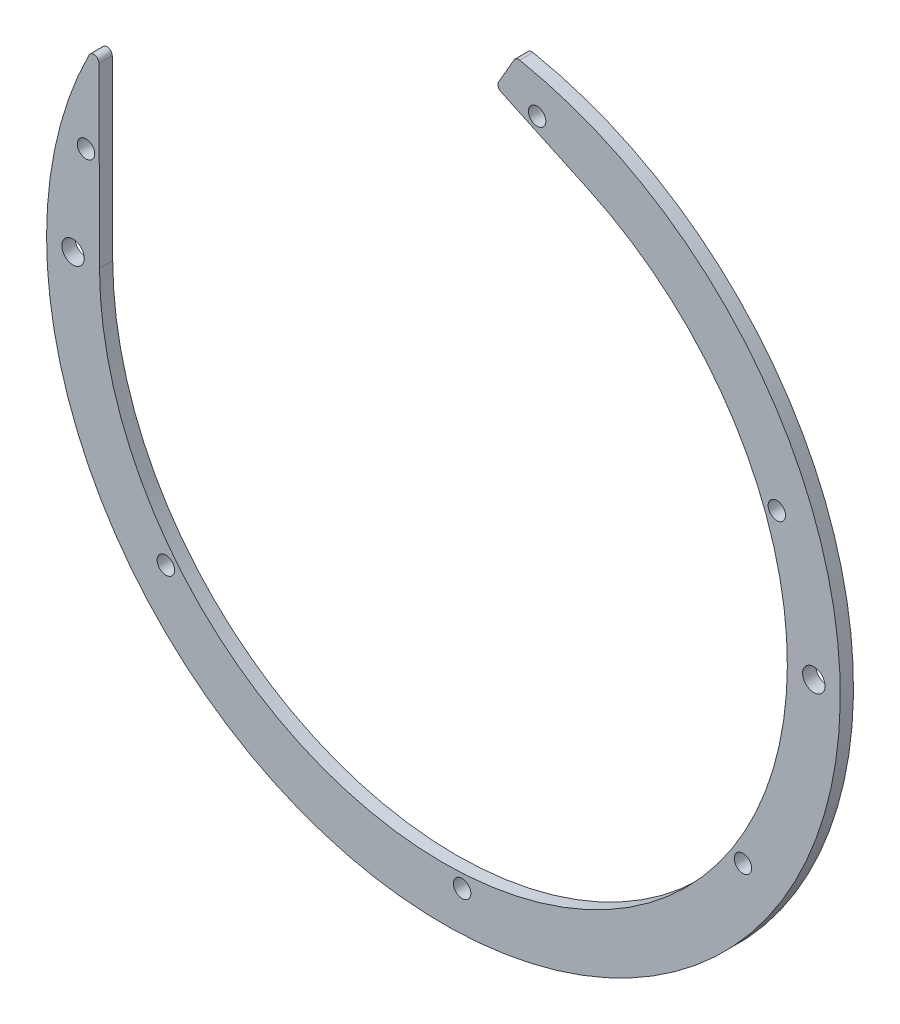
ISO-10303-21;
HEADER;
FILE_DESCRIPTION(('STEP AP214'),'2;1');
FILE_NAME('part.step','',(''),(''),'','','');
FILE_SCHEMA(('AUTOMOTIVE_DESIGN { 1 0 10303 214 1 1 1 1 }'));
ENDSEC;
DATA;
#1=APPLICATION_CONTEXT('core data for automotive mechanical design processes');
#2=APPLICATION_PROTOCOL_DEFINITION('international standard','automotive_design',2000,#1);
#3=PRODUCT_CONTEXT('',#1,'mechanical');
#4=PRODUCT('Part','Part','',(#3));
#5=PRODUCT_RELATED_PRODUCT_CATEGORY('part','',(#4));
#6=PRODUCT_DEFINITION_FORMATION('','',#4);
#7=PRODUCT_DEFINITION_CONTEXT('part definition',#1,'design');
#8=PRODUCT_DEFINITION('design','',#6,#7);
#9=PRODUCT_DEFINITION_SHAPE('','',#8);
#10=(LENGTH_UNIT() NAMED_UNIT(*) SI_UNIT(.MILLI.,.METRE.));
#11=(NAMED_UNIT(*) PLANE_ANGLE_UNIT() SI_UNIT($,.RADIAN.));
#12=(NAMED_UNIT(*) SI_UNIT($,.STERADIAN.) SOLID_ANGLE_UNIT());
#13=UNCERTAINTY_MEASURE_WITH_UNIT(LENGTH_MEASURE(1.E-05),#10,'distance_accuracy_value','');
#14=(GEOMETRIC_REPRESENTATION_CONTEXT(3) GLOBAL_UNCERTAINTY_ASSIGNED_CONTEXT((#13)) GLOBAL_UNIT_ASSIGNED_CONTEXT((#10,
#11,#12)) REPRESENTATION_CONTEXT('',''));
#15=CARTESIAN_POINT('',(0.,0.,0.));
#16=DIRECTION('',(0.,0.,1.));
#17=DIRECTION('',(1.,0.,0.));
#18=AXIS2_PLACEMENT_3D('',#15,#16,#17);
#19=CARTESIAN_POINT('',(0.,0.,-5.));
#20=DIRECTION('',(0.,0.,1.));
#21=DIRECTION('',(-1.,0.,0.));
#22=AXIS2_PLACEMENT_3D('',#19,#20,#21);
#23=CYLINDRICAL_SURFACE('',#22,150.);
#24=CARTESIAN_POINT('',(0.,0.,0.));
#25=DIRECTION('',(0.,0.,1.));
#26=DIRECTION('',(-1.,0.,0.));
#27=AXIS2_PLACEMENT_3D('',#24,#25,#26);
#28=CIRCLE('',#27,150.);
#29=CARTESIAN_POINT('',(-133.953391528007,67.5017695926886,0.));
#30=VERTEX_POINT('',#29);
#31=CARTESIAN_POINT('',(28.8334780285495,147.202685249887,0.));
#32=VERTEX_POINT('',#31);
#33=EDGE_CURVE('E135',#30,#32,#28,.T.);
#34=ORIENTED_EDGE('',*,*,#33,.F.);
#35=DIRECTION('',(0.,0.,1.));
#36=VECTOR('',#35,1.);
#37=CARTESIAN_POINT('',(-133.953391528007,67.5017695926886,-5.));
#38=LINE('',#37,#36);
#39=CARTESIAN_POINT('',(-133.953391528007,67.5017695926886,-5.));
#40=VERTEX_POINT('',#39);
#41=EDGE_CURVE('E190',#40,#30,#38,.T.);
#42=ORIENTED_EDGE('',*,*,#41,.F.);
#43=CARTESIAN_POINT('',(0.,0.,-5.));
#44=DIRECTION('',(0.,0.,1.));
#45=DIRECTION('',(-1.,0.,0.));
#46=AXIS2_PLACEMENT_3D('',#43,#44,#45);
#47=CIRCLE('',#46,150.);
#48=CARTESIAN_POINT('',(28.8334780285495,147.202685249887,-5.));
#49=VERTEX_POINT('',#48);
#50=EDGE_CURVE('E130',#40,#49,#47,.T.);
#51=ORIENTED_EDGE('',*,*,#50,.T.);
#52=DIRECTION('',(0.,0.,1.));
#53=VECTOR('',#52,1.);
#54=CARTESIAN_POINT('',(28.8334780285495,147.202685249887,-5.));
#55=LINE('',#54,#53);
#56=EDGE_CURVE('E47',#32,#49,#55,.F.);
#57=ORIENTED_EDGE('',*,*,#56,.F.);
#58=EDGE_LOOP('',(#34,#42,#51,#57));
#59=FACE_BOUND('',#58,.T.);
#60=ADVANCED_FACE('F38',(#59),#23,.T.);
#61=CARTESIAN_POINT('',(27.4277530561865,147.471076358345,-5.));
#62=DIRECTION('',(0.866025403784439,-0.5,0.));
#63=DIRECTION('',(0.5,0.866025403784439,0.));
#64=AXIS2_PLACEMENT_3D('',#61,#62,#63);
#65=PLANE('',#64);
#66=DIRECTION('',(-0.5,-0.866025403784439,0.));
#67=VECTOR('',#66,1.);
#68=CARTESIAN_POINT('',(27.4277530561865,147.471076358345,0.));
#69=LINE('',#68,#67);
#70=CARTESIAN_POINT('',(26.7169808472666,146.239982779888,0.));
#71=VERTEX_POINT('',#70);
#72=CARTESIAN_POINT('',(20.8671165029872,136.107720518211,0.));
#73=VERTEX_POINT('',#72);
#74=EDGE_CURVE('E138',#71,#73,#69,.T.);
#75=ORIENTED_EDGE('',*,*,#74,.F.);
#76=DIRECTION('',(0.,0.,1.));
#77=VECTOR('',#76,1.);
#78=CARTESIAN_POINT('',(26.7169808472666,146.239982779888,-5.));
#79=LINE('',#78,#77);
#80=CARTESIAN_POINT('',(26.7169808472666,146.239982779888,-5.));
#81=VERTEX_POINT('',#80);
#82=EDGE_CURVE('E180',#81,#71,#79,.T.);
#83=ORIENTED_EDGE('',*,*,#82,.F.);
#84=DIRECTION('',(-0.5,-0.866025403784439,0.));
#85=VECTOR('',#84,1.);
#86=CARTESIAN_POINT('',(27.4277530561865,147.471076358345,-5.));
#87=LINE('',#86,#85);
#88=CARTESIAN_POINT('',(20.8671165029872,136.107720518211,-5.));
#89=VERTEX_POINT('',#88);
#90=EDGE_CURVE('E127',#81,#89,#87,.T.);
#91=ORIENTED_EDGE('',*,*,#90,.T.);
#92=DIRECTION('',(0.,0.,1.));
#93=VECTOR('',#92,1.);
#94=CARTESIAN_POINT('',(20.8671165029872,136.107720518211,-5.));
#95=LINE('',#94,#93);
#96=EDGE_CURVE('E183',#73,#89,#95,.F.);
#97=ORIENTED_EDGE('',*,*,#96,.F.);
#98=EDGE_LOOP('',(#75,#83,#91,#97));
#99=FACE_BOUND('',#98,.T.);
#100=ADVANCED_FACE('F234',(#99),#65,.F.);
#101=CARTESIAN_POINT('',(54.940374026291,117.820012314764,-5.));
#102=DIRECTION('',(0.4226182617407,0.90630778703665,0.));
#103=DIRECTION('',(-0.90630778703665,0.4226182617407,0.));
#104=AXIS2_PLACEMENT_3D('',#101,#102,#103);
#105=PLANE('',#104);
#106=DIRECTION('',(0.90630778703665,-0.4226182617407,0.));
#107=VECTOR('',#106,1.);
#108=CARTESIAN_POINT('',(54.940374026291,117.820012314764,-5.));
#109=LINE('',#108,#107);
#110=CARTESIAN_POINT('',(21.7539307870747,133.295104944137,-5.));
#111=VERTEX_POINT('',#110);
#112=CARTESIAN_POINT('',(54.940374026291,117.820012314764,-5.));
#113=VERTEX_POINT('',#112);
#114=EDGE_CURVE('E106',#111,#113,#109,.T.);
#115=ORIENTED_EDGE('',*,*,#114,.T.);
#116=DIRECTION('',(0.,0.,1.));
#117=VECTOR('',#116,1.);
#118=CARTESIAN_POINT('',(54.940374026291,117.820012314764,-5.));
#119=LINE('',#118,#117);
#120=CARTESIAN_POINT('',(54.940374026291,117.820012314764,0.));
#121=VERTEX_POINT('',#120);
#122=EDGE_CURVE('E114',#113,#121,#119,.T.);
#123=ORIENTED_EDGE('',*,*,#122,.T.);
#124=DIRECTION('',(0.90630778703665,-0.4226182617407,0.));
#125=VECTOR('',#124,1.);
#126=CARTESIAN_POINT('',(54.940374026291,117.820012314764,0.));
#127=LINE('',#126,#125);
#128=CARTESIAN_POINT('',(21.7539307870747,133.295104944137,0.));
#129=VERTEX_POINT('',#128);
#130=EDGE_CURVE('E142',#129,#121,#127,.T.);
#131=ORIENTED_EDGE('',*,*,#130,.F.);
#132=DIRECTION('',(0.,0.,1.));
#133=VECTOR('',#132,1.);
#134=CARTESIAN_POINT('',(21.7539307870747,133.295104944137,-5.));
#135=LINE('',#134,#133);
#136=EDGE_CURVE('E121',#111,#129,#135,.T.);
#137=ORIENTED_EDGE('',*,*,#136,.F.);
#138=EDGE_LOOP('',(#115,#123,#131,#137));
#139=FACE_BOUND('',#138,.T.);
#140=ADVANCED_FACE('F125',(#139),#105,.F.);
#141=CARTESIAN_POINT('',(0.,0.,-5.));
#142=DIRECTION('',(0.,0.,1.));
#143=DIRECTION('',(-1.,0.,0.));
#144=AXIS2_PLACEMENT_3D('',#141,#142,#143);
#145=CYLINDRICAL_SURFACE('',#144,130.);
#146=CARTESIAN_POINT('',(0.,0.,0.));
#147=DIRECTION('',(0.,0.,-1.));
#148=DIRECTION('',(-1.,0.,0.));
#149=AXIS2_PLACEMENT_3D('',#146,#147,#148);
#150=CIRCLE('',#149,130.);
#151=CARTESIAN_POINT('',(-129.999591664017,-0.325833069146089,0.));
#152=VERTEX_POINT('',#151);
#153=EDGE_CURVE('E117',#121,#152,#150,.T.);
#154=ORIENTED_EDGE('',*,*,#153,.F.);
#155=ORIENTED_EDGE('',*,*,#122,.F.);
#156=CARTESIAN_POINT('',(0.,0.,-5.));
#157=DIRECTION('',(0.,0.,-1.));
#158=DIRECTION('',(-1.,0.,0.));
#159=AXIS2_PLACEMENT_3D('',#156,#157,#158);
#160=CIRCLE('',#159,130.);
#161=CARTESIAN_POINT('',(-129.999591664017,-0.325833069146089,-5.));
#162=VERTEX_POINT('',#161);
#163=EDGE_CURVE('E102',#113,#162,#160,.T.);
#164=ORIENTED_EDGE('',*,*,#163,.T.);
#165=DIRECTION('',(0.,0.,1.));
#166=VECTOR('',#165,1.);
#167=CARTESIAN_POINT('',(-129.999591664017,-0.325833069146089,-5.));
#168=LINE('',#167,#166);
#169=EDGE_CURVE('E122',#162,#152,#168,.T.);
#170=ORIENTED_EDGE('',*,*,#169,.T.);
#171=EDGE_LOOP('',(#154,#155,#164,#170));
#172=FACE_BOUND('',#171,.T.);
#173=ADVANCED_FACE('F115',(#172),#145,.F.);
#174=CARTESIAN_POINT('',(-130.187154080944,74.5070796119715,-5.));
#175=DIRECTION('',(-0.999996858953974,-0.0025064082242006,0.));
#176=DIRECTION('',(0.0025064082242006,-0.999996858953974,0.));
#177=AXIS2_PLACEMENT_3D('',#174,#175,#176);
#178=PLANE('',#177);
#179=DIRECTION('',(-0.0025064082242006,0.999996858953974,0.));
#180=VECTOR('',#179,1.);
#181=CARTESIAN_POINT('',(-130.187154080944,74.5070796119715,0.));
#182=LINE('',#181,#180);
#183=CARTESIAN_POINT('',(-130.167352589726,66.6067588145679,0.));
#184=VERTEX_POINT('',#183);
#185=EDGE_CURVE('E145',#152,#184,#182,.T.);
#186=ORIENTED_EDGE('',*,*,#185,.F.);
#187=ORIENTED_EDGE('',*,*,#169,.F.);
#188=DIRECTION('',(-0.0025064082242006,0.999996858953974,0.));
#189=VECTOR('',#188,1.);
#190=CARTESIAN_POINT('',(-130.187154080944,74.5070796119715,-5.));
#191=LINE('',#190,#189);
#192=CARTESIAN_POINT('',(-130.167352589726,66.6067588145679,-5.));
#193=VERTEX_POINT('',#192);
#194=EDGE_CURVE('E108',#162,#193,#191,.T.);
#195=ORIENTED_EDGE('',*,*,#194,.T.);
#196=DIRECTION('',(0.,0.,1.));
#197=VECTOR('',#196,1.);
#198=CARTESIAN_POINT('',(-130.167352589726,66.6067588145679,-5.));
#199=LINE('',#198,#197);
#200=EDGE_CURVE('E11',#184,#193,#199,.F.);
#201=ORIENTED_EDGE('',*,*,#200,.F.);
#202=EDGE_LOOP('',(#186,#187,#195,#201));
#203=FACE_BOUND('',#202,.T.);
#204=ADVANCED_FACE('F225',(#203),#178,.F.);
#205=CARTESIAN_POINT('',(0.,0.,-5.));
#206=DIRECTION('',(0.,0.,1.));
#207=DIRECTION('',(-1.,0.,0.));
#208=AXIS2_PLACEMENT_3D('',#205,#206,#207);
#209=PLANE('',#208);
#210=CARTESIAN_POINT('',(-140.,0.,-5.));
#211=DIRECTION('',(0.,0.,1.));
#212=DIRECTION('',(1.,0.,0.));
#213=AXIS2_PLACEMENT_3D('',#210,#211,#212);
#214=CIRCLE('',#213,4.25);
#215=CARTESIAN_POINT('',(-135.75,0.,-5.));
#216=VERTEX_POINT('',#215);
#217=EDGE_CURVE('E195',#216,#216,#214,.T.);
#218=ORIENTED_EDGE('',*,*,#217,.T.);
#219=EDGE_LOOP('',(#218));
#220=FACE_BOUND('',#219,.T.);
#221=CARTESIAN_POINT('',(140.,-9.6038628438766E-13,-5.));
#222=DIRECTION('',(0.,0.,1.));
#223=DIRECTION('',(1.,0.,0.));
#224=AXIS2_PLACEMENT_3D('',#221,#222,#223);
#225=CIRCLE('',#224,4.25);
#226=CARTESIAN_POINT('',(144.25,-9.6038628438766E-13,-5.));
#227=VERTEX_POINT('',#226);
#228=EDGE_CURVE('E172',#227,#227,#225,.T.);
#229=ORIENTED_EDGE('',*,*,#228,.T.);
#230=EDGE_LOOP('',(#229));
#231=FACE_BOUND('',#230,.T.);
#232=CARTESIAN_POINT('',(126.033357577122,48.3796731886171,-5.));
#233=DIRECTION('',(0.,0.,-1.));
#234=DIRECTION('',(-1.,0.,0.));
#235=AXIS2_PLACEMENT_3D('',#232,#233,#234);
#236=CIRCLE('',#235,3.3);
#237=CARTESIAN_POINT('',(122.733357577122,48.3796731886171,-5.));
#238=VERTEX_POINT('',#237);
#239=EDGE_CURVE('E168',#238,#238,#236,.T.);
#240=ORIENTED_EDGE('',*,*,#239,.F.);
#241=EDGE_LOOP('',(#240));
#242=FACE_BOUND('',#241,.T.);
#243=CARTESIAN_POINT('',(35.411080451429,132.155951395642,-5.));
#244=DIRECTION('',(0.,0.,-1.));
#245=DIRECTION('',(-1.,0.,0.));
#246=AXIS2_PLACEMENT_3D('',#243,#244,#245);
#247=CIRCLE('',#246,3.3);
#248=CARTESIAN_POINT('',(32.111080451429,132.155951395642,-5.));
#249=VERTEX_POINT('',#248);
#250=EDGE_CURVE('E164',#249,#249,#247,.T.);
#251=ORIENTED_EDGE('',*,*,#250,.F.);
#252=EDGE_LOOP('',(#251));
#253=FACE_BOUND('',#252,.T.);
#254=CARTESIAN_POINT('',(113.220526672633,-73.5262697270275,-5.));
#255=DIRECTION('',(0.,0.,-1.));
#256=DIRECTION('',(-1.,0.,0.));
#257=AXIS2_PLACEMENT_3D('',#254,#255,#256);
#258=CIRCLE('',#257,3.3);
#259=CARTESIAN_POINT('',(109.920526672633,-73.5262697270275,-5.));
#260=VERTEX_POINT('',#259);
#261=EDGE_CURVE('E160',#260,#260,#258,.T.);
#262=ORIENTED_EDGE('',*,*,#261,.F.);
#263=EDGE_LOOP('',(#262));
#264=FACE_BOUND('',#263,.T.);
#265=CARTESIAN_POINT('',(7.06535409279951,-134.814987191867,-5.));
#266=DIRECTION('',(0.,0.,-1.));
#267=DIRECTION('',(-1.,0.,0.));
#268=AXIS2_PLACEMENT_3D('',#265,#266,#267);
#269=CIRCLE('',#268,3.3);
#270=CARTESIAN_POINT('',(3.76535409279952,-134.814987191867,-5.));
#271=VERTEX_POINT('',#270);
#272=EDGE_CURVE('E156',#271,#271,#269,.T.);
#273=ORIENTED_EDGE('',*,*,#272,.F.);
#274=EDGE_LOOP('',(#273));
#275=FACE_BOUND('',#274,.T.);
#276=CARTESIAN_POINT('',(-104.914704796689,-84.9582527917303,-5.));
#277=DIRECTION('',(0.,0.,-1.));
#278=DIRECTION('',(-1.,0.,0.));
#279=AXIS2_PLACEMENT_3D('',#276,#277,#278);
#280=CIRCLE('',#279,3.3);
#281=CARTESIAN_POINT('',(-108.214704796689,-84.9582527917303,-5.));
#282=VERTEX_POINT('',#281);
#283=EDGE_CURVE('E152',#282,#282,#280,.T.);
#284=ORIENTED_EDGE('',*,*,#283,.F.);
#285=EDGE_LOOP('',(#284));
#286=FACE_BOUND('',#285,.T.);
#287=CARTESIAN_POINT('',(-135.091150201132,36.1975646009845,-5.));
#288=DIRECTION('',(0.,0.,-1.));
#289=DIRECTION('',(-1.,0.,0.));
#290=AXIS2_PLACEMENT_3D('',#287,#288,#289);
#291=CIRCLE('',#290,3.3);
#292=CARTESIAN_POINT('',(-138.391150201132,36.1975646009845,-5.));
#293=VERTEX_POINT('',#292);
#294=EDGE_CURVE('E139',#293,#293,#291,.T.);
#295=ORIENTED_EDGE('',*,*,#294,.F.);
#296=EDGE_LOOP('',(#295));
#297=FACE_BOUND('',#296,.T.);
#298=ORIENTED_EDGE('',*,*,#90,.F.);
#299=CARTESIAN_POINT('',(28.4490316548355,145.239982779888,-5.));
#300=DIRECTION('',(0.,0.,-1.));
#301=DIRECTION('',(-1.,0.,0.));
#302=AXIS2_PLACEMENT_3D('',#299,#300,#301);
#303=CIRCLE('',#302,2.);
#304=EDGE_CURVE('E60',#49,#81,#303,.F.);
#305=ORIENTED_EDGE('',*,*,#304,.F.);
#306=ORIENTED_EDGE('',*,*,#50,.F.);
#307=CARTESIAN_POINT('',(-132.167346307634,66.6017459981195,-5.));
#308=DIRECTION('',(0.,0.,-1.));
#309=DIRECTION('',(-1.,0.,0.));
#310=AXIS2_PLACEMENT_3D('',#307,#308,#309);
#311=CIRCLE('',#310,2.);
#312=EDGE_CURVE('E55',#193,#40,#311,.F.);
#313=ORIENTED_EDGE('',*,*,#312,.F.);
#314=ORIENTED_EDGE('',*,*,#194,.F.);
#315=ORIENTED_EDGE('',*,*,#163,.F.);
#316=ORIENTED_EDGE('',*,*,#114,.F.);
#317=CARTESIAN_POINT('',(22.5991673105561,135.107720518211,-5.));
#318=DIRECTION('',(0.,0.,-1.));
#319=DIRECTION('',(-1.,0.,0.));
#320=AXIS2_PLACEMENT_3D('',#317,#318,#319);
#321=CIRCLE('',#320,2.);
#322=EDGE_CURVE('E188',#89,#111,#321,.F.);
#323=ORIENTED_EDGE('',*,*,#322,.F.);
#324=EDGE_LOOP('',(#298,#305,#306,#313,#314,#315,#316,#323));
#325=FACE_BOUND('',#324,.T.);
#326=ADVANCED_FACE('F104',(#220,#231,#242,#253,#264,#275,#286,#297,#325),#209,.F.);
#327=CARTESIAN_POINT('',(0.,0.,0.));
#328=DIRECTION('',(0.,0.,1.));
#329=DIRECTION('',(-1.,0.,0.));
#330=AXIS2_PLACEMENT_3D('',#327,#328,#329);
#331=PLANE('',#330);
#332=CARTESIAN_POINT('',(-140.,0.,0.));
#333=DIRECTION('',(0.,0.,1.));
#334=DIRECTION('',(1.,0.,0.));
#335=AXIS2_PLACEMENT_3D('',#332,#333,#334);
#336=CIRCLE('',#335,4.25);
#337=CARTESIAN_POINT('',(-135.75,0.,0.));
#338=VERTEX_POINT('',#337);
#339=EDGE_CURVE('E42',#338,#338,#336,.T.);
#340=ORIENTED_EDGE('',*,*,#339,.F.);
#341=EDGE_LOOP('',(#340));
#342=FACE_BOUND('',#341,.T.);
#343=CARTESIAN_POINT('',(140.,-9.6038628438766E-13,0.));
#344=DIRECTION('',(0.,0.,1.));
#345=DIRECTION('',(1.,0.,0.));
#346=AXIS2_PLACEMENT_3D('',#343,#344,#345);
#347=CIRCLE('',#346,4.25);
#348=CARTESIAN_POINT('',(144.25,-9.6038628438766E-13,0.));
#349=VERTEX_POINT('',#348);
#350=EDGE_CURVE('E193',#349,#349,#347,.T.);
#351=ORIENTED_EDGE('',*,*,#350,.F.);
#352=EDGE_LOOP('',(#351));
#353=FACE_BOUND('',#352,.T.);
#354=CARTESIAN_POINT('',(126.033357577122,48.3796731886171,0.));
#355=DIRECTION('',(0.,0.,-1.));
#356=DIRECTION('',(-1.,0.,0.));
#357=AXIS2_PLACEMENT_3D('',#354,#355,#356);
#358=CIRCLE('',#357,3.3);
#359=CARTESIAN_POINT('',(122.733357577122,48.3796731886171,0.));
#360=VERTEX_POINT('',#359);
#361=EDGE_CURVE('E169',#360,#360,#358,.T.);
#362=ORIENTED_EDGE('',*,*,#361,.T.);
#363=EDGE_LOOP('',(#362));
#364=FACE_BOUND('',#363,.T.);
#365=CARTESIAN_POINT('',(35.411080451429,132.155951395642,0.));
#366=DIRECTION('',(0.,0.,-1.));
#367=DIRECTION('',(-1.,0.,0.));
#368=AXIS2_PLACEMENT_3D('',#365,#366,#367);
#369=CIRCLE('',#368,3.3);
#370=CARTESIAN_POINT('',(32.111080451429,132.155951395642,0.));
#371=VERTEX_POINT('',#370);
#372=EDGE_CURVE('E165',#371,#371,#369,.T.);
#373=ORIENTED_EDGE('',*,*,#372,.T.);
#374=EDGE_LOOP('',(#373));
#375=FACE_BOUND('',#374,.T.);
#376=CARTESIAN_POINT('',(113.220526672633,-73.5262697270275,0.));
#377=DIRECTION('',(0.,0.,-1.));
#378=DIRECTION('',(-1.,0.,0.));
#379=AXIS2_PLACEMENT_3D('',#376,#377,#378);
#380=CIRCLE('',#379,3.3);
#381=CARTESIAN_POINT('',(109.920526672633,-73.5262697270275,0.));
#382=VERTEX_POINT('',#381);
#383=EDGE_CURVE('E161',#382,#382,#380,.T.);
#384=ORIENTED_EDGE('',*,*,#383,.T.);
#385=EDGE_LOOP('',(#384));
#386=FACE_BOUND('',#385,.T.);
#387=CARTESIAN_POINT('',(7.06535409279951,-134.814987191867,0.));
#388=DIRECTION('',(0.,0.,-1.));
#389=DIRECTION('',(-1.,0.,0.));
#390=AXIS2_PLACEMENT_3D('',#387,#388,#389);
#391=CIRCLE('',#390,3.3);
#392=CARTESIAN_POINT('',(3.76535409279952,-134.814987191867,0.));
#393=VERTEX_POINT('',#392);
#394=EDGE_CURVE('E157',#393,#393,#391,.T.);
#395=ORIENTED_EDGE('',*,*,#394,.T.);
#396=EDGE_LOOP('',(#395));
#397=FACE_BOUND('',#396,.T.);
#398=CARTESIAN_POINT('',(-104.914704796689,-84.9582527917303,0.));
#399=DIRECTION('',(0.,0.,-1.));
#400=DIRECTION('',(-1.,0.,0.));
#401=AXIS2_PLACEMENT_3D('',#398,#399,#400);
#402=CIRCLE('',#401,3.3);
#403=CARTESIAN_POINT('',(-108.214704796689,-84.9582527917303,0.));
#404=VERTEX_POINT('',#403);
#405=EDGE_CURVE('E153',#404,#404,#402,.T.);
#406=ORIENTED_EDGE('',*,*,#405,.T.);
#407=EDGE_LOOP('',(#406));
#408=FACE_BOUND('',#407,.T.);
#409=CARTESIAN_POINT('',(-135.091150201132,36.1975646009845,0.));
#410=DIRECTION('',(0.,0.,-1.));
#411=DIRECTION('',(-1.,0.,0.));
#412=AXIS2_PLACEMENT_3D('',#409,#410,#411);
#413=CIRCLE('',#412,3.3);
#414=CARTESIAN_POINT('',(-138.391150201132,36.1975646009845,0.));
#415=VERTEX_POINT('',#414);
#416=EDGE_CURVE('E149',#415,#415,#413,.T.);
#417=ORIENTED_EDGE('',*,*,#416,.T.);
#418=EDGE_LOOP('',(#417));
#419=FACE_BOUND('',#418,.T.);
#420=ORIENTED_EDGE('',*,*,#130,.T.);
#421=ORIENTED_EDGE('',*,*,#153,.T.);
#422=ORIENTED_EDGE('',*,*,#185,.T.);
#423=CARTESIAN_POINT('',(-132.167346307634,66.6017459981195,0.));
#424=DIRECTION('',(0.,0.,-1.));
#425=DIRECTION('',(-1.,0.,0.));
#426=AXIS2_PLACEMENT_3D('',#423,#424,#425);
#427=CIRCLE('',#426,2.);
#428=EDGE_CURVE('E174',#30,#184,#427,.T.);
#429=ORIENTED_EDGE('',*,*,#428,.F.);
#430=ORIENTED_EDGE('',*,*,#33,.T.);
#431=CARTESIAN_POINT('',(28.4490316548355,145.239982779888,0.));
#432=DIRECTION('',(0.,0.,-1.));
#433=DIRECTION('',(-1.,0.,0.));
#434=AXIS2_PLACEMENT_3D('',#431,#432,#433);
#435=CIRCLE('',#434,2.);
#436=EDGE_CURVE('E176',#71,#32,#435,.T.);
#437=ORIENTED_EDGE('',*,*,#436,.F.);
#438=ORIENTED_EDGE('',*,*,#74,.T.);
#439=CARTESIAN_POINT('',(22.5991673105561,135.107720518211,0.));
#440=DIRECTION('',(0.,0.,-1.));
#441=DIRECTION('',(-1.,0.,0.));
#442=AXIS2_PLACEMENT_3D('',#439,#440,#441);
#443=CIRCLE('',#442,2.);
#444=EDGE_CURVE('E178',#129,#73,#443,.T.);
#445=ORIENTED_EDGE('',*,*,#444,.F.);
#446=EDGE_LOOP('',(#420,#421,#422,#429,#430,#437,#438,#445));
#447=FACE_BOUND('',#446,.T.);
#448=ADVANCED_FACE('F227',(#342,#353,#364,#375,#386,#397,#408,#419,#447),#331,.T.);
#449=CARTESIAN_POINT('',(-135.091150201132,36.1975646009845,5.));
#450=DIRECTION('',(0.,0.,1.));
#451=DIRECTION('',(-1.,0.,0.));
#452=AXIS2_PLACEMENT_3D('',#449,#450,#451);
#453=CYLINDRICAL_SURFACE('',#452,3.3);
#454=ORIENTED_EDGE('',*,*,#416,.F.);
#455=EDGE_LOOP('',(#454));
#456=FACE_BOUND('',#455,.T.);
#457=ORIENTED_EDGE('',*,*,#294,.T.);
#458=EDGE_LOOP('',(#457));
#459=FACE_BOUND('',#458,.T.);
#460=ADVANCED_FACE('F260',(#456,#459),#453,.F.);
#461=CARTESIAN_POINT('',(-104.914704796689,-84.9582527917303,5.));
#462=DIRECTION('',(0.,0.,1.));
#463=DIRECTION('',(-1.,0.,0.));
#464=AXIS2_PLACEMENT_3D('',#461,#462,#463);
#465=CYLINDRICAL_SURFACE('',#464,3.3);
#466=ORIENTED_EDGE('',*,*,#405,.F.);
#467=EDGE_LOOP('',(#466));
#468=FACE_BOUND('',#467,.T.);
#469=ORIENTED_EDGE('',*,*,#283,.T.);
#470=EDGE_LOOP('',(#469));
#471=FACE_BOUND('',#470,.T.);
#472=ADVANCED_FACE('F266',(#468,#471),#465,.F.);
#473=CARTESIAN_POINT('',(7.06535409279951,-134.814987191867,5.));
#474=DIRECTION('',(0.,0.,1.));
#475=DIRECTION('',(-1.,0.,0.));
#476=AXIS2_PLACEMENT_3D('',#473,#474,#475);
#477=CYLINDRICAL_SURFACE('',#476,3.3);
#478=ORIENTED_EDGE('',*,*,#394,.F.);
#479=EDGE_LOOP('',(#478));
#480=FACE_BOUND('',#479,.T.);
#481=ORIENTED_EDGE('',*,*,#272,.T.);
#482=EDGE_LOOP('',(#481));
#483=FACE_BOUND('',#482,.T.);
#484=ADVANCED_FACE('F270',(#480,#483),#477,.F.);
#485=CARTESIAN_POINT('',(113.220526672633,-73.5262697270275,5.));
#486=DIRECTION('',(0.,0.,1.));
#487=DIRECTION('',(-1.,0.,0.));
#488=AXIS2_PLACEMENT_3D('',#485,#486,#487);
#489=CYLINDRICAL_SURFACE('',#488,3.3);
#490=ORIENTED_EDGE('',*,*,#383,.F.);
#491=EDGE_LOOP('',(#490));
#492=FACE_BOUND('',#491,.T.);
#493=ORIENTED_EDGE('',*,*,#261,.T.);
#494=EDGE_LOOP('',(#493));
#495=FACE_BOUND('',#494,.T.);
#496=ADVANCED_FACE('F274',(#492,#495),#489,.F.);
#497=CARTESIAN_POINT('',(35.411080451429,132.155951395642,5.));
#498=DIRECTION('',(0.,0.,1.));
#499=DIRECTION('',(-1.,0.,0.));
#500=AXIS2_PLACEMENT_3D('',#497,#498,#499);
#501=CYLINDRICAL_SURFACE('',#500,3.3);
#502=ORIENTED_EDGE('',*,*,#372,.F.);
#503=EDGE_LOOP('',(#502));
#504=FACE_BOUND('',#503,.T.);
#505=ORIENTED_EDGE('',*,*,#250,.T.);
#506=EDGE_LOOP('',(#505));
#507=FACE_BOUND('',#506,.T.);
#508=ADVANCED_FACE('F278',(#504,#507),#501,.F.);
#509=CARTESIAN_POINT('',(126.033357577122,48.3796731886171,5.));
#510=DIRECTION('',(0.,0.,1.));
#511=DIRECTION('',(-1.,0.,0.));
#512=AXIS2_PLACEMENT_3D('',#509,#510,#511);
#513=CYLINDRICAL_SURFACE('',#512,3.3);
#514=ORIENTED_EDGE('',*,*,#361,.F.);
#515=EDGE_LOOP('',(#514));
#516=FACE_BOUND('',#515,.T.);
#517=ORIENTED_EDGE('',*,*,#239,.T.);
#518=EDGE_LOOP('',(#517));
#519=FACE_BOUND('',#518,.T.);
#520=ADVANCED_FACE('F243',(#516,#519),#513,.F.);
#521=CARTESIAN_POINT('',(22.5991673105561,135.107720518211,-5.));
#522=DIRECTION('',(0.,0.,1.));
#523=DIRECTION('',(-1.,0.,0.));
#524=AXIS2_PLACEMENT_3D('',#521,#522,#523);
#525=CYLINDRICAL_SURFACE('',#524,2.);
#526=ORIENTED_EDGE('',*,*,#322,.T.);
#527=ORIENTED_EDGE('',*,*,#136,.T.);
#528=ORIENTED_EDGE('',*,*,#444,.T.);
#529=ORIENTED_EDGE('',*,*,#96,.T.);
#530=EDGE_LOOP('',(#526,#527,#528,#529));
#531=FACE_BOUND('',#530,.T.);
#532=ADVANCED_FACE('F231',(#531),#525,.T.);
#533=CARTESIAN_POINT('',(28.4490316548355,145.239982779888,-5.));
#534=DIRECTION('',(0.,0.,1.));
#535=DIRECTION('',(-1.,0.,0.));
#536=AXIS2_PLACEMENT_3D('',#533,#534,#535);
#537=CYLINDRICAL_SURFACE('',#536,2.);
#538=ORIENTED_EDGE('',*,*,#304,.T.);
#539=ORIENTED_EDGE('',*,*,#82,.T.);
#540=ORIENTED_EDGE('',*,*,#436,.T.);
#541=ORIENTED_EDGE('',*,*,#56,.T.);
#542=EDGE_LOOP('',(#538,#539,#540,#541));
#543=FACE_BOUND('',#542,.T.);
#544=ADVANCED_FACE('F236',(#543),#537,.T.);
#545=CARTESIAN_POINT('',(-132.167346307634,66.6017459981195,-5.));
#546=DIRECTION('',(0.,0.,1.));
#547=DIRECTION('',(-1.,0.,0.));
#548=AXIS2_PLACEMENT_3D('',#545,#546,#547);
#549=CYLINDRICAL_SURFACE('',#548,2.);
#550=ORIENTED_EDGE('',*,*,#312,.T.);
#551=ORIENTED_EDGE('',*,*,#41,.T.);
#552=ORIENTED_EDGE('',*,*,#428,.T.);
#553=ORIENTED_EDGE('',*,*,#200,.T.);
#554=EDGE_LOOP('',(#550,#551,#552,#553));
#555=FACE_BOUND('',#554,.T.);
#556=ADVANCED_FACE('F40',(#555),#549,.T.);
#557=CARTESIAN_POINT('',(140.,-9.6038628438766E-13,5.));
#558=DIRECTION('',(0.,0.,1.));
#559=DIRECTION('',(1.,0.,0.));
#560=AXIS2_PLACEMENT_3D('',#557,#558,#559);
#561=CYLINDRICAL_SURFACE('',#560,4.25);
#562=ORIENTED_EDGE('',*,*,#350,.T.);
#563=EDGE_LOOP('',(#562));
#564=FACE_BOUND('',#563,.T.);
#565=ORIENTED_EDGE('',*,*,#228,.F.);
#566=EDGE_LOOP('',(#565));
#567=FACE_BOUND('',#566,.T.);
#568=ADVANCED_FACE('F242',(#564,#567),#561,.F.);
#569=CARTESIAN_POINT('',(-140.,0.,5.));
#570=DIRECTION('',(0.,0.,1.));
#571=DIRECTION('',(1.,0.,0.));
#572=AXIS2_PLACEMENT_3D('',#569,#570,#571);
#573=CYLINDRICAL_SURFACE('',#572,4.25);
#574=ORIENTED_EDGE('',*,*,#339,.T.);
#575=EDGE_LOOP('',(#574));
#576=FACE_BOUND('',#575,.T.);
#577=ORIENTED_EDGE('',*,*,#217,.F.);
#578=EDGE_LOOP('',(#577));
#579=FACE_BOUND('',#578,.T.);
#580=ADVANCED_FACE('F288',(#576,#579),#573,.F.);
#581=CLOSED_SHELL('',(#60,#100,#140,#173,#204,#326,#448,#460,#472,#484,#496,#508,#520,#532,#544,
#556,#568,#580));
#582=MANIFOLD_SOLID_BREP('B2',#581);
#583=ADVANCED_BREP_SHAPE_REPRESENTATION('',(#18,#582),#14);
#584=SHAPE_DEFINITION_REPRESENTATION(#9,#583);
ENDSEC;
END-ISO-10303-21;
